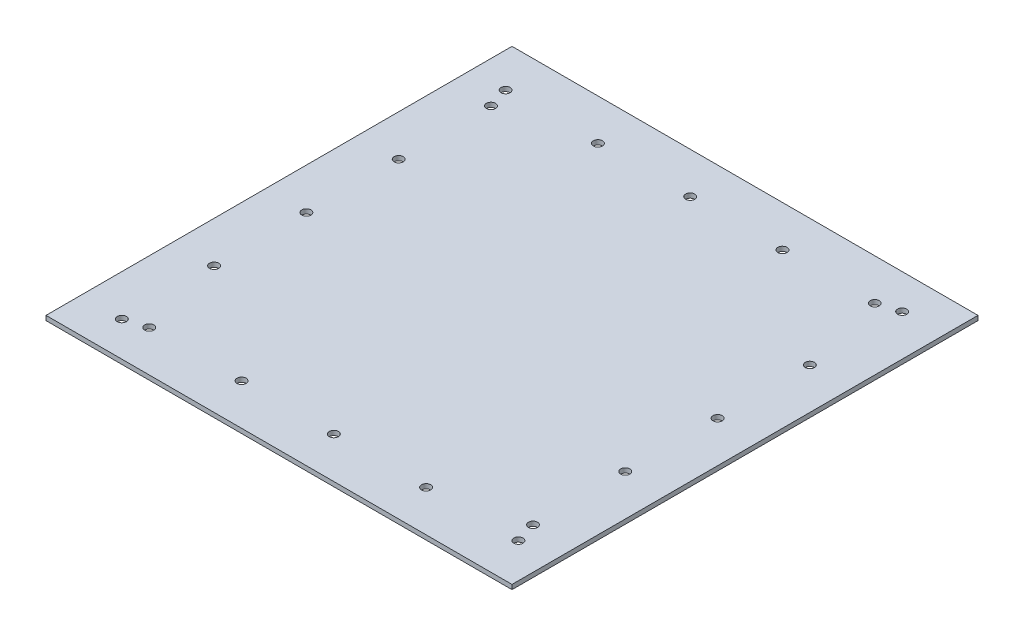
ISO-10303-21;
HEADER;
FILE_DESCRIPTION(('STEP AP214'),'2;1');
FILE_NAME('part.step','',(''),(''),'','','');
FILE_SCHEMA(('AUTOMOTIVE_DESIGN { 1 0 10303 214 1 1 1 1 }'));
ENDSEC;
DATA;
#1=APPLICATION_CONTEXT('core data for automotive mechanical design processes');
#2=APPLICATION_PROTOCOL_DEFINITION('international standard','automotive_design',2000,#1);
#3=PRODUCT_CONTEXT('',#1,'mechanical');
#4=PRODUCT('Part','Part','',(#3));
#5=PRODUCT_RELATED_PRODUCT_CATEGORY('part','',(#4));
#6=PRODUCT_DEFINITION_FORMATION('','',#4);
#7=PRODUCT_DEFINITION_CONTEXT('part definition',#1,'design');
#8=PRODUCT_DEFINITION('design','',#6,#7);
#9=PRODUCT_DEFINITION_SHAPE('','',#8);
#10=(LENGTH_UNIT() NAMED_UNIT(*) SI_UNIT(.MILLI.,.METRE.));
#11=(NAMED_UNIT(*) PLANE_ANGLE_UNIT() SI_UNIT($,.RADIAN.));
#12=(NAMED_UNIT(*) SI_UNIT($,.STERADIAN.) SOLID_ANGLE_UNIT());
#13=UNCERTAINTY_MEASURE_WITH_UNIT(LENGTH_MEASURE(1.E-05),#10,'distance_accuracy_value','');
#14=(GEOMETRIC_REPRESENTATION_CONTEXT(3) GLOBAL_UNCERTAINTY_ASSIGNED_CONTEXT((#13)) GLOBAL_UNIT_ASSIGNED_CONTEXT((#10,
#11,#12)) REPRESENTATION_CONTEXT('',''));
#15=CARTESIAN_POINT('',(0.,0.,0.));
#16=DIRECTION('',(0.,0.,1.));
#17=DIRECTION('',(1.,0.,0.));
#18=AXIS2_PLACEMENT_3D('',#15,#16,#17);
#19=CARTESIAN_POINT('',(255.,5.,255.));
#20=DIRECTION('',(-1.,0.,0.));
#21=DIRECTION('',(0.,0.,1.));
#22=AXIS2_PLACEMENT_3D('',#19,#20,#21);
#23=PLANE('',#22);
#24=DIRECTION('',(0.,0.,-1.));
#25=VECTOR('',#24,1.);
#26=CARTESIAN_POINT('',(255.,0.,255.));
#27=LINE('',#26,#25);
#28=CARTESIAN_POINT('',(255.,0.,255.));
#29=VERTEX_POINT('',#28);
#30=CARTESIAN_POINT('',(255.,0.,-255.));
#31=VERTEX_POINT('',#30);
#32=EDGE_CURVE('E109',#29,#31,#27,.T.);
#33=ORIENTED_EDGE('',*,*,#32,.T.);
#34=DIRECTION('',(0.,-1.,0.));
#35=VECTOR('',#34,1.);
#36=CARTESIAN_POINT('',(255.,5.,-255.));
#37=LINE('',#36,#35);
#38=CARTESIAN_POINT('',(255.,5.,-255.));
#39=VERTEX_POINT('',#38);
#40=EDGE_CURVE('E11',#39,#31,#37,.T.);
#41=ORIENTED_EDGE('',*,*,#40,.F.);
#42=DIRECTION('',(0.,0.,-1.));
#43=VECTOR('',#42,1.);
#44=CARTESIAN_POINT('',(255.,5.,255.));
#45=LINE('',#44,#43);
#46=CARTESIAN_POINT('',(255.,5.,255.));
#47=VERTEX_POINT('',#46);
#48=EDGE_CURVE('E92',#47,#39,#45,.T.);
#49=ORIENTED_EDGE('',*,*,#48,.F.);
#50=DIRECTION('',(0.,-1.,0.));
#51=VECTOR('',#50,1.);
#52=CARTESIAN_POINT('',(255.,5.,255.));
#53=LINE('',#52,#51);
#54=EDGE_CURVE('E105',#47,#29,#53,.T.);
#55=ORIENTED_EDGE('',*,*,#54,.T.);
#56=EDGE_LOOP('',(#33,#41,#49,#55));
#57=FACE_BOUND('',#56,.T.);
#58=ADVANCED_FACE('F39',(#57),#23,.F.);
#59=CARTESIAN_POINT('',(-255.,5.,-255.));
#60=DIRECTION('',(0.,0.,1.));
#61=DIRECTION('',(1.,0.,0.));
#62=AXIS2_PLACEMENT_3D('',#59,#60,#61);
#63=PLANE('',#62);
#64=DIRECTION('',(-1.,0.,0.));
#65=VECTOR('',#64,1.);
#66=CARTESIAN_POINT('',(-255.,0.,-255.));
#67=LINE('',#66,#65);
#68=CARTESIAN_POINT('',(-255.,0.,-255.));
#69=VERTEX_POINT('',#68);
#70=EDGE_CURVE('E97',#31,#69,#67,.T.);
#71=ORIENTED_EDGE('',*,*,#70,.T.);
#72=DIRECTION('',(0.,-1.,0.));
#73=VECTOR('',#72,1.);
#74=CARTESIAN_POINT('',(-255.,5.,-255.));
#75=LINE('',#74,#73);
#76=CARTESIAN_POINT('',(-255.,5.,-255.));
#77=VERTEX_POINT('',#76);
#78=EDGE_CURVE('E47',#77,#69,#75,.T.);
#79=ORIENTED_EDGE('',*,*,#78,.F.);
#80=DIRECTION('',(-1.,0.,0.));
#81=VECTOR('',#80,1.);
#82=CARTESIAN_POINT('',(-255.,5.,-255.));
#83=LINE('',#82,#81);
#84=EDGE_CURVE('E86',#39,#77,#83,.T.);
#85=ORIENTED_EDGE('',*,*,#84,.F.);
#86=ORIENTED_EDGE('',*,*,#40,.T.);
#87=EDGE_LOOP('',(#71,#79,#85,#86));
#88=FACE_BOUND('',#87,.T.);
#89=ADVANCED_FACE('F96',(#88),#63,.F.);
#90=CARTESIAN_POINT('',(-255.,5.,255.));
#91=DIRECTION('',(1.,0.,0.));
#92=DIRECTION('',(0.,0.,-1.));
#93=AXIS2_PLACEMENT_3D('',#90,#91,#92);
#94=PLANE('',#93);
#95=DIRECTION('',(0.,0.,1.));
#96=VECTOR('',#95,1.);
#97=CARTESIAN_POINT('',(-255.,0.,255.));
#98=LINE('',#97,#96);
#99=CARTESIAN_POINT('',(-255.,0.,255.));
#100=VERTEX_POINT('',#99);
#101=EDGE_CURVE('E73',#69,#100,#98,.T.);
#102=ORIENTED_EDGE('',*,*,#101,.T.);
#103=DIRECTION('',(0.,-1.,0.));
#104=VECTOR('',#103,1.);
#105=CARTESIAN_POINT('',(-255.,5.,255.));
#106=LINE('',#105,#104);
#107=CARTESIAN_POINT('',(-255.,5.,255.));
#108=VERTEX_POINT('',#107);
#109=EDGE_CURVE('E99',#108,#100,#106,.T.);
#110=ORIENTED_EDGE('',*,*,#109,.F.);
#111=DIRECTION('',(0.,0.,1.));
#112=VECTOR('',#111,1.);
#113=CARTESIAN_POINT('',(-255.,5.,255.));
#114=LINE('',#113,#112);
#115=EDGE_CURVE('E90',#77,#108,#114,.T.);
#116=ORIENTED_EDGE('',*,*,#115,.F.);
#117=ORIENTED_EDGE('',*,*,#78,.T.);
#118=EDGE_LOOP('',(#102,#110,#116,#117));
#119=FACE_BOUND('',#118,.T.);
#120=ADVANCED_FACE('F100',(#119),#94,.F.);
#121=CARTESIAN_POINT('',(-255.,5.,255.));
#122=DIRECTION('',(0.,0.,-1.));
#123=DIRECTION('',(-1.,0.,0.));
#124=AXIS2_PLACEMENT_3D('',#121,#122,#123);
#125=PLANE('',#124);
#126=DIRECTION('',(1.,0.,0.));
#127=VECTOR('',#126,1.);
#128=CARTESIAN_POINT('',(-255.,0.,255.));
#129=LINE('',#128,#127);
#130=EDGE_CURVE('E79',#100,#29,#129,.T.);
#131=ORIENTED_EDGE('',*,*,#130,.T.);
#132=ORIENTED_EDGE('',*,*,#54,.F.);
#133=DIRECTION('',(1.,0.,0.));
#134=VECTOR('',#133,1.);
#135=CARTESIAN_POINT('',(-255.,5.,255.));
#136=LINE('',#135,#134);
#137=EDGE_CURVE('E55',#108,#47,#136,.T.);
#138=ORIENTED_EDGE('',*,*,#137,.F.);
#139=ORIENTED_EDGE('',*,*,#109,.T.);
#140=EDGE_LOOP('',(#131,#132,#138,#139));
#141=FACE_BOUND('',#140,.T.);
#142=ADVANCED_FACE('F121',(#141),#125,.F.);
#143=CARTESIAN_POINT('',(0.,5.,0.));
#144=DIRECTION('',(0.,-1.,0.));
#145=DIRECTION('',(0.,0.,-1.));
#146=AXIS2_PLACEMENT_3D('',#143,#144,#145);
#147=PLANE('',#146);
#148=CARTESIAN_POINT('',(-209.999999999997,5.,-86.0000000000001));
#149=DIRECTION('',(0.,-1.,0.));
#150=DIRECTION('',(0.,0.,-1.));
#151=AXIS2_PLACEMENT_3D('',#148,#149,#150);
#152=CIRCLE('',#151,4.99999999999999);
#153=CARTESIAN_POINT('',(-209.999999999997,5.,-91.0000000000001));
#154=VERTEX_POINT('',#153);
#155=EDGE_CURVE('E179',#154,#154,#152,.T.);
#156=ORIENTED_EDGE('',*,*,#155,.T.);
#157=EDGE_LOOP('',(#156));
#158=FACE_BOUND('',#157,.T.);
#159=CARTESIAN_POINT('',(-209.999999999996,5.,-187.));
#160=DIRECTION('',(0.,-1.,0.));
#161=DIRECTION('',(0.,0.,-1.));
#162=AXIS2_PLACEMENT_3D('',#159,#160,#161);
#163=CIRCLE('',#162,4.99999999999999);
#164=CARTESIAN_POINT('',(-209.999999999996,5.,-192.));
#165=VERTEX_POINT('',#164);
#166=EDGE_CURVE('E204',#165,#165,#163,.T.);
#167=ORIENTED_EDGE('',*,*,#166,.T.);
#168=EDGE_LOOP('',(#167));
#169=FACE_BOUND('',#168,.T.);
#170=CARTESIAN_POINT('',(210.,5.,-217.));
#171=DIRECTION('',(0.,-1.,0.));
#172=DIRECTION('',(0.,0.,-1.));
#173=AXIS2_PLACEMENT_3D('',#170,#171,#172);
#174=CIRCLE('',#173,4.99999999999999);
#175=CARTESIAN_POINT('',(210.,5.,-222.));
#176=VERTEX_POINT('',#175);
#177=EDGE_CURVE('E197',#176,#176,#174,.T.);
#178=ORIENTED_EDGE('',*,*,#177,.T.);
#179=EDGE_LOOP('',(#178));
#180=FACE_BOUND('',#179,.T.);
#181=CARTESIAN_POINT('',(-116.,5.,-210.));
#182=DIRECTION('',(0.,-1.,0.));
#183=DIRECTION('',(0.,0.,-1.));
#184=AXIS2_PLACEMENT_3D('',#181,#182,#183);
#185=CIRCLE('',#184,4.99999999999999);
#186=CARTESIAN_POINT('',(-116.,5.,-215.));
#187=VERTEX_POINT('',#186);
#188=EDGE_CURVE('E190',#187,#187,#185,.T.);
#189=ORIENTED_EDGE('',*,*,#188,.T.);
#190=EDGE_LOOP('',(#189));
#191=FACE_BOUND('',#190,.T.);
#192=CARTESIAN_POINT('',(-15.,5.,-210.));
#193=DIRECTION('',(0.,-1.,0.));
#194=DIRECTION('',(0.,0.,-1.));
#195=AXIS2_PLACEMENT_3D('',#192,#193,#194);
#196=CIRCLE('',#195,4.99999999999999);
#197=CARTESIAN_POINT('',(-15.,5.,-215.));
#198=VERTEX_POINT('',#197);
#199=EDGE_CURVE('E191',#198,#198,#196,.T.);
#200=ORIENTED_EDGE('',*,*,#199,.T.);
#201=EDGE_LOOP('',(#200));
#202=FACE_BOUND('',#201,.T.);
#203=CARTESIAN_POINT('',(86.0000000000001,5.,-210.));
#204=DIRECTION('',(0.,-1.,0.));
#205=DIRECTION('',(0.,0.,-1.));
#206=AXIS2_PLACEMENT_3D('',#203,#204,#205);
#207=CIRCLE('',#206,4.99999999999999);
#208=CARTESIAN_POINT('',(86.0000000000001,5.,-215.));
#209=VERTEX_POINT('',#208);
#210=EDGE_CURVE('E230',#209,#209,#207,.T.);
#211=ORIENTED_EDGE('',*,*,#210,.T.);
#212=EDGE_LOOP('',(#211));
#213=FACE_BOUND('',#212,.T.);
#214=CARTESIAN_POINT('',(187.,5.,-210.));
#215=DIRECTION('',(0.,-1.,0.));
#216=DIRECTION('',(0.,0.,-1.));
#217=AXIS2_PLACEMENT_3D('',#214,#215,#216);
#218=CIRCLE('',#217,4.99999999999999);
#219=CARTESIAN_POINT('',(187.,5.,-215.));
#220=VERTEX_POINT('',#219);
#221=EDGE_CURVE('E224',#220,#220,#218,.T.);
#222=ORIENTED_EDGE('',*,*,#221,.T.);
#223=EDGE_LOOP('',(#222));
#224=FACE_BOUND('',#223,.T.);
#225=CARTESIAN_POINT('',(210.,5.,-116.));
#226=DIRECTION('',(0.,-1.,0.));
#227=DIRECTION('',(0.,0.,-1.));
#228=AXIS2_PLACEMENT_3D('',#225,#226,#227);
#229=CIRCLE('',#228,4.99999999999999);
#230=CARTESIAN_POINT('',(210.,5.,-121.));
#231=VERTEX_POINT('',#230);
#232=EDGE_CURVE('E216',#231,#231,#229,.T.);
#233=ORIENTED_EDGE('',*,*,#232,.T.);
#234=EDGE_LOOP('',(#233));
#235=FACE_BOUND('',#234,.T.);
#236=CARTESIAN_POINT('',(-86.0000000000001,5.,209.999999999998));
#237=DIRECTION('',(0.,-1.,0.));
#238=DIRECTION('',(0.,0.,-1.));
#239=AXIS2_PLACEMENT_3D('',#236,#237,#238);
#240=CIRCLE('',#239,4.99999999999999);
#241=CARTESIAN_POINT('',(-86.0000000000001,5.,204.999999999998));
#242=VERTEX_POINT('',#241);
#243=EDGE_CURVE('E150',#242,#242,#240,.T.);
#244=ORIENTED_EDGE('',*,*,#243,.T.);
#245=EDGE_LOOP('',(#244));
#246=FACE_BOUND('',#245,.T.);
#247=CARTESIAN_POINT('',(15.,5.,209.999999999999));
#248=DIRECTION('',(0.,-1.,0.));
#249=DIRECTION('',(0.,0.,-1.));
#250=AXIS2_PLACEMENT_3D('',#247,#248,#249);
#251=CIRCLE('',#250,4.99999999999999);
#252=CARTESIAN_POINT('',(15.,5.,204.999999999999));
#253=VERTEX_POINT('',#252);
#254=EDGE_CURVE('E139',#253,#253,#251,.T.);
#255=ORIENTED_EDGE('',*,*,#254,.T.);
#256=EDGE_LOOP('',(#255));
#257=FACE_BOUND('',#256,.T.);
#258=CARTESIAN_POINT('',(116.,5.,209.999999999999));
#259=DIRECTION('',(0.,-1.,0.));
#260=DIRECTION('',(0.,0.,-1.));
#261=AXIS2_PLACEMENT_3D('',#258,#259,#260);
#262=CIRCLE('',#261,4.99999999999999);
#263=CARTESIAN_POINT('',(116.,5.,204.999999999999));
#264=VERTEX_POINT('',#263);
#265=EDGE_CURVE('E138',#264,#264,#262,.T.);
#266=ORIENTED_EDGE('',*,*,#265,.T.);
#267=EDGE_LOOP('',(#266));
#268=FACE_BOUND('',#267,.T.);
#269=CARTESIAN_POINT('',(-210.,5.,217.));
#270=DIRECTION('',(0.,-1.,0.));
#271=DIRECTION('',(0.,0.,-1.));
#272=AXIS2_PLACEMENT_3D('',#269,#270,#271);
#273=CIRCLE('',#272,4.99999999999999);
#274=CARTESIAN_POINT('',(-210.,5.,212.));
#275=VERTEX_POINT('',#274);
#276=EDGE_CURVE('E132',#275,#275,#273,.T.);
#277=ORIENTED_EDGE('',*,*,#276,.T.);
#278=EDGE_LOOP('',(#277));
#279=FACE_BOUND('',#278,.T.);
#280=CARTESIAN_POINT('',(-209.999999999998,5.,15.));
#281=DIRECTION('',(0.,-1.,0.));
#282=DIRECTION('',(0.,0.,-1.));
#283=AXIS2_PLACEMENT_3D('',#280,#281,#282);
#284=CIRCLE('',#283,4.99999999999999);
#285=CARTESIAN_POINT('',(-209.999999999998,5.,9.99999999999997));
#286=VERTEX_POINT('',#285);
#287=EDGE_CURVE('E178',#286,#286,#284,.T.);
#288=ORIENTED_EDGE('',*,*,#287,.T.);
#289=EDGE_LOOP('',(#288));
#290=FACE_BOUND('',#289,.T.);
#291=CARTESIAN_POINT('',(-209.999999999999,5.,116.));
#292=DIRECTION('',(0.,-1.,0.));
#293=DIRECTION('',(0.,0.,-1.));
#294=AXIS2_PLACEMENT_3D('',#291,#292,#293);
#295=CIRCLE('',#294,4.99999999999999);
#296=CARTESIAN_POINT('',(-209.999999999999,5.,111.));
#297=VERTEX_POINT('',#296);
#298=EDGE_CURVE('E166',#297,#297,#295,.T.);
#299=ORIENTED_EDGE('',*,*,#298,.T.);
#300=EDGE_LOOP('',(#299));
#301=FACE_BOUND('',#300,.T.);
#302=CARTESIAN_POINT('',(-217.,5.,-210.));
#303=DIRECTION('',(0.,-1.,0.));
#304=DIRECTION('',(0.,0.,-1.));
#305=AXIS2_PLACEMENT_3D('',#302,#303,#304);
#306=CIRCLE('',#305,4.99999999999999);
#307=CARTESIAN_POINT('',(-217.,5.,-215.));
#308=VERTEX_POINT('',#307);
#309=EDGE_CURVE('E165',#308,#308,#306,.T.);
#310=ORIENTED_EDGE('',*,*,#309,.T.);
#311=EDGE_LOOP('',(#310));
#312=FACE_BOUND('',#311,.T.);
#313=CARTESIAN_POINT('',(-187.,5.,209.999999999997));
#314=DIRECTION('',(0.,-1.,0.));
#315=DIRECTION('',(0.,0.,-1.));
#316=AXIS2_PLACEMENT_3D('',#313,#314,#315);
#317=CIRCLE('',#316,4.99999999999999);
#318=CARTESIAN_POINT('',(-187.,5.,204.999999999997));
#319=VERTEX_POINT('',#318);
#320=EDGE_CURVE('E151',#319,#319,#317,.T.);
#321=ORIENTED_EDGE('',*,*,#320,.T.);
#322=EDGE_LOOP('',(#321));
#323=FACE_BOUND('',#322,.T.);
#324=CARTESIAN_POINT('',(209.999999999999,5.,-15.));
#325=DIRECTION('',(0.,-1.,0.));
#326=DIRECTION('',(0.,0.,-1.));
#327=AXIS2_PLACEMENT_3D('',#324,#325,#326);
#328=CIRCLE('',#327,4.99999999999999);
#329=CARTESIAN_POINT('',(209.999999999999,5.,-19.9999999999999));
#330=VERTEX_POINT('',#329);
#331=EDGE_CURVE('E217',#330,#330,#328,.T.);
#332=ORIENTED_EDGE('',*,*,#331,.T.);
#333=EDGE_LOOP('',(#332));
#334=FACE_BOUND('',#333,.T.);
#335=CARTESIAN_POINT('',(209.999999999999,5.,86.0000000000001));
#336=DIRECTION('',(0.,-1.,0.));
#337=DIRECTION('',(0.,0.,-1.));
#338=AXIS2_PLACEMENT_3D('',#335,#336,#337);
#339=CIRCLE('',#338,4.99999999999999);
#340=CARTESIAN_POINT('',(209.999999999999,5.,81.0000000000001));
#341=VERTEX_POINT('',#340);
#342=EDGE_CURVE('E247',#341,#341,#339,.T.);
#343=ORIENTED_EDGE('',*,*,#342,.T.);
#344=EDGE_LOOP('',(#343));
#345=FACE_BOUND('',#344,.T.);
#346=CARTESIAN_POINT('',(209.999999999999,5.,187.));
#347=DIRECTION('',(0.,-1.,0.));
#348=DIRECTION('',(0.,0.,-1.));
#349=AXIS2_PLACEMENT_3D('',#346,#347,#348);
#350=CIRCLE('',#349,4.99999999999999);
#351=CARTESIAN_POINT('',(209.999999999999,5.,182.));
#352=VERTEX_POINT('',#351);
#353=EDGE_CURVE('E241',#352,#352,#350,.T.);
#354=ORIENTED_EDGE('',*,*,#353,.T.);
#355=EDGE_LOOP('',(#354));
#356=FACE_BOUND('',#355,.T.);
#357=CARTESIAN_POINT('',(217.,5.,210.));
#358=DIRECTION('',(0.,-1.,0.));
#359=DIRECTION('',(0.,0.,-1.));
#360=AXIS2_PLACEMENT_3D('',#357,#358,#359);
#361=CIRCLE('',#360,4.99999999999999);
#362=CARTESIAN_POINT('',(217.,5.,205.));
#363=VERTEX_POINT('',#362);
#364=EDGE_CURVE('E113',#363,#363,#361,.T.);
#365=ORIENTED_EDGE('',*,*,#364,.T.);
#366=EDGE_LOOP('',(#365));
#367=FACE_BOUND('',#366,.T.);
#368=ORIENTED_EDGE('',*,*,#48,.T.);
#369=ORIENTED_EDGE('',*,*,#84,.T.);
#370=ORIENTED_EDGE('',*,*,#115,.T.);
#371=ORIENTED_EDGE('',*,*,#137,.T.);
#372=EDGE_LOOP('',(#368,#369,#370,#371));
#373=FACE_BOUND('',#372,.T.);
#374=ADVANCED_FACE('F88',(#158,#169,#180,#191,#202,#213,#224,#235,#246,#257,#268,#279,#290,#301,
#312,#323,#334,#345,#356,#367,#373),#147,.F.);
#375=CARTESIAN_POINT('',(0.,0.,0.));
#376=DIRECTION('',(0.,-1.,0.));
#377=DIRECTION('',(0.,0.,-1.));
#378=AXIS2_PLACEMENT_3D('',#375,#376,#377);
#379=PLANE('',#378);
#380=CARTESIAN_POINT('',(-209.999999999997,0.,-86.0000000000001));
#381=DIRECTION('',(0.,-1.,0.));
#382=DIRECTION('',(0.,0.,-1.));
#383=AXIS2_PLACEMENT_3D('',#380,#381,#382);
#384=CIRCLE('',#383,4.99999999999999);
#385=CARTESIAN_POINT('',(-209.999999999997,0.,-91.0000000000001));
#386=VERTEX_POINT('',#385);
#387=EDGE_CURVE('E207',#386,#386,#384,.T.);
#388=ORIENTED_EDGE('',*,*,#387,.F.);
#389=EDGE_LOOP('',(#388));
#390=FACE_BOUND('',#389,.T.);
#391=CARTESIAN_POINT('',(-209.999999999996,0.,-187.));
#392=DIRECTION('',(0.,-1.,0.));
#393=DIRECTION('',(0.,0.,-1.));
#394=AXIS2_PLACEMENT_3D('',#391,#392,#393);
#395=CIRCLE('',#394,4.99999999999999);
#396=CARTESIAN_POINT('',(-209.999999999996,0.,-192.));
#397=VERTEX_POINT('',#396);
#398=EDGE_CURVE('E200',#397,#397,#395,.T.);
#399=ORIENTED_EDGE('',*,*,#398,.F.);
#400=EDGE_LOOP('',(#399));
#401=FACE_BOUND('',#400,.T.);
#402=CARTESIAN_POINT('',(210.,0.,-217.));
#403=DIRECTION('',(0.,-1.,0.));
#404=DIRECTION('',(0.,0.,-1.));
#405=AXIS2_PLACEMENT_3D('',#402,#403,#404);
#406=CIRCLE('',#405,4.99999999999999);
#407=CARTESIAN_POINT('',(210.,0.,-222.));
#408=VERTEX_POINT('',#407);
#409=EDGE_CURVE('E194',#408,#408,#406,.T.);
#410=ORIENTED_EDGE('',*,*,#409,.F.);
#411=EDGE_LOOP('',(#410));
#412=FACE_BOUND('',#411,.T.);
#413=CARTESIAN_POINT('',(-116.,0.,-210.));
#414=DIRECTION('',(0.,-1.,0.));
#415=DIRECTION('',(0.,0.,-1.));
#416=AXIS2_PLACEMENT_3D('',#413,#414,#415);
#417=CIRCLE('',#416,4.99999999999999);
#418=CARTESIAN_POINT('',(-116.,0.,-215.));
#419=VERTEX_POINT('',#418);
#420=EDGE_CURVE('E187',#419,#419,#417,.T.);
#421=ORIENTED_EDGE('',*,*,#420,.F.);
#422=EDGE_LOOP('',(#421));
#423=FACE_BOUND('',#422,.T.);
#424=CARTESIAN_POINT('',(-15.,0.,-210.));
#425=DIRECTION('',(0.,-1.,0.));
#426=DIRECTION('',(0.,0.,-1.));
#427=AXIS2_PLACEMENT_3D('',#424,#425,#426);
#428=CIRCLE('',#427,4.99999999999999);
#429=CARTESIAN_POINT('',(-15.,0.,-215.));
#430=VERTEX_POINT('',#429);
#431=EDGE_CURVE('E233',#430,#430,#428,.T.);
#432=ORIENTED_EDGE('',*,*,#431,.F.);
#433=EDGE_LOOP('',(#432));
#434=FACE_BOUND('',#433,.T.);
#435=CARTESIAN_POINT('',(86.0000000000001,0.,-210.));
#436=DIRECTION('',(0.,-1.,0.));
#437=DIRECTION('',(0.,0.,-1.));
#438=AXIS2_PLACEMENT_3D('',#435,#436,#437);
#439=CIRCLE('',#438,4.99999999999999);
#440=CARTESIAN_POINT('',(86.0000000000001,0.,-215.));
#441=VERTEX_POINT('',#440);
#442=EDGE_CURVE('E227',#441,#441,#439,.T.);
#443=ORIENTED_EDGE('',*,*,#442,.F.);
#444=EDGE_LOOP('',(#443));
#445=FACE_BOUND('',#444,.T.);
#446=CARTESIAN_POINT('',(187.,0.,-210.));
#447=DIRECTION('',(0.,-1.,0.));
#448=DIRECTION('',(0.,0.,-1.));
#449=AXIS2_PLACEMENT_3D('',#446,#447,#448);
#450=CIRCLE('',#449,4.99999999999999);
#451=CARTESIAN_POINT('',(187.,0.,-215.));
#452=VERTEX_POINT('',#451);
#453=EDGE_CURVE('E221',#452,#452,#450,.T.);
#454=ORIENTED_EDGE('',*,*,#453,.F.);
#455=EDGE_LOOP('',(#454));
#456=FACE_BOUND('',#455,.T.);
#457=CARTESIAN_POINT('',(210.,0.,-116.));
#458=DIRECTION('',(0.,-1.,0.));
#459=DIRECTION('',(0.,0.,-1.));
#460=AXIS2_PLACEMENT_3D('',#457,#458,#459);
#461=CIRCLE('',#460,4.99999999999999);
#462=CARTESIAN_POINT('',(210.,0.,-121.));
#463=VERTEX_POINT('',#462);
#464=EDGE_CURVE('E212',#463,#463,#461,.T.);
#465=ORIENTED_EDGE('',*,*,#464,.F.);
#466=EDGE_LOOP('',(#465));
#467=FACE_BOUND('',#466,.T.);
#468=CARTESIAN_POINT('',(-86.0000000000001,0.,209.999999999998));
#469=DIRECTION('',(0.,-1.,0.));
#470=DIRECTION('',(0.,0.,-1.));
#471=AXIS2_PLACEMENT_3D('',#468,#469,#470);
#472=CIRCLE('',#471,4.99999999999999);
#473=CARTESIAN_POINT('',(-86.0000000000001,0.,204.999999999998));
#474=VERTEX_POINT('',#473);
#475=EDGE_CURVE('E147',#474,#474,#472,.T.);
#476=ORIENTED_EDGE('',*,*,#475,.F.);
#477=EDGE_LOOP('',(#476));
#478=FACE_BOUND('',#477,.T.);
#479=CARTESIAN_POINT('',(15.,0.,209.999999999999));
#480=DIRECTION('',(0.,-1.,0.));
#481=DIRECTION('',(0.,0.,-1.));
#482=AXIS2_PLACEMENT_3D('',#479,#480,#481);
#483=CIRCLE('',#482,4.99999999999999);
#484=CARTESIAN_POINT('',(15.,0.,204.999999999999));
#485=VERTEX_POINT('',#484);
#486=EDGE_CURVE('E154',#485,#485,#483,.T.);
#487=ORIENTED_EDGE('',*,*,#486,.F.);
#488=EDGE_LOOP('',(#487));
#489=FACE_BOUND('',#488,.T.);
#490=CARTESIAN_POINT('',(116.,0.,209.999999999999));
#491=DIRECTION('',(0.,-1.,0.));
#492=DIRECTION('',(0.,0.,-1.));
#493=AXIS2_PLACEMENT_3D('',#490,#491,#492);
#494=CIRCLE('',#493,4.99999999999999);
#495=CARTESIAN_POINT('',(116.,0.,204.999999999999));
#496=VERTEX_POINT('',#495);
#497=EDGE_CURVE('E135',#496,#496,#494,.T.);
#498=ORIENTED_EDGE('',*,*,#497,.F.);
#499=EDGE_LOOP('',(#498));
#500=FACE_BOUND('',#499,.T.);
#501=CARTESIAN_POINT('',(-210.,0.,217.));
#502=DIRECTION('',(0.,-1.,0.));
#503=DIRECTION('',(0.,0.,-1.));
#504=AXIS2_PLACEMENT_3D('',#501,#502,#503);
#505=CIRCLE('',#504,4.99999999999999);
#506=CARTESIAN_POINT('',(-210.,0.,212.));
#507=VERTEX_POINT('',#506);
#508=EDGE_CURVE('E142',#507,#507,#505,.T.);
#509=ORIENTED_EDGE('',*,*,#508,.F.);
#510=EDGE_LOOP('',(#509));
#511=FACE_BOUND('',#510,.T.);
#512=CARTESIAN_POINT('',(-209.999999999998,0.,15.));
#513=DIRECTION('',(0.,-1.,0.));
#514=DIRECTION('',(0.,0.,-1.));
#515=AXIS2_PLACEMENT_3D('',#512,#513,#514);
#516=CIRCLE('',#515,4.99999999999999);
#517=CARTESIAN_POINT('',(-209.999999999998,0.,9.99999999999997));
#518=VERTEX_POINT('',#517);
#519=EDGE_CURVE('E175',#518,#518,#516,.T.);
#520=ORIENTED_EDGE('',*,*,#519,.F.);
#521=EDGE_LOOP('',(#520));
#522=FACE_BOUND('',#521,.T.);
#523=CARTESIAN_POINT('',(-209.999999999999,0.,116.));
#524=DIRECTION('',(0.,-1.,0.));
#525=DIRECTION('',(0.,0.,-1.));
#526=AXIS2_PLACEMENT_3D('',#523,#524,#525);
#527=CIRCLE('',#526,4.99999999999999);
#528=CARTESIAN_POINT('',(-209.999999999999,0.,111.));
#529=VERTEX_POINT('',#528);
#530=EDGE_CURVE('E182',#529,#529,#527,.T.);
#531=ORIENTED_EDGE('',*,*,#530,.F.);
#532=EDGE_LOOP('',(#531));
#533=FACE_BOUND('',#532,.T.);
#534=CARTESIAN_POINT('',(-217.,0.,-210.));
#535=DIRECTION('',(0.,-1.,0.));
#536=DIRECTION('',(0.,0.,-1.));
#537=AXIS2_PLACEMENT_3D('',#534,#535,#536);
#538=CIRCLE('',#537,4.99999999999999);
#539=CARTESIAN_POINT('',(-217.,0.,-215.));
#540=VERTEX_POINT('',#539);
#541=EDGE_CURVE('E161',#540,#540,#538,.T.);
#542=ORIENTED_EDGE('',*,*,#541,.F.);
#543=EDGE_LOOP('',(#542));
#544=FACE_BOUND('',#543,.T.);
#545=CARTESIAN_POINT('',(-187.,0.,209.999999999997));
#546=DIRECTION('',(0.,-1.,0.));
#547=DIRECTION('',(0.,0.,-1.));
#548=AXIS2_PLACEMENT_3D('',#545,#546,#547);
#549=CIRCLE('',#548,4.99999999999999);
#550=CARTESIAN_POINT('',(-187.,0.,204.999999999997));
#551=VERTEX_POINT('',#550);
#552=EDGE_CURVE('E170',#551,#551,#549,.T.);
#553=ORIENTED_EDGE('',*,*,#552,.F.);
#554=EDGE_LOOP('',(#553));
#555=FACE_BOUND('',#554,.T.);
#556=CARTESIAN_POINT('',(209.999999999999,0.,-15.));
#557=DIRECTION('',(0.,-1.,0.));
#558=DIRECTION('',(0.,0.,-1.));
#559=AXIS2_PLACEMENT_3D('',#556,#557,#558);
#560=CIRCLE('',#559,4.99999999999999);
#561=CARTESIAN_POINT('',(209.999999999999,0.,-19.9999999999999));
#562=VERTEX_POINT('',#561);
#563=EDGE_CURVE('E251',#562,#562,#560,.T.);
#564=ORIENTED_EDGE('',*,*,#563,.F.);
#565=EDGE_LOOP('',(#564));
#566=FACE_BOUND('',#565,.T.);
#567=CARTESIAN_POINT('',(209.999999999999,0.,86.0000000000001));
#568=DIRECTION('',(0.,-1.,0.));
#569=DIRECTION('',(0.,0.,-1.));
#570=AXIS2_PLACEMENT_3D('',#567,#568,#569);
#571=CIRCLE('',#570,4.99999999999999);
#572=CARTESIAN_POINT('',(209.999999999999,0.,81.0000000000001));
#573=VERTEX_POINT('',#572);
#574=EDGE_CURVE('E244',#573,#573,#571,.T.);
#575=ORIENTED_EDGE('',*,*,#574,.F.);
#576=EDGE_LOOP('',(#575));
#577=FACE_BOUND('',#576,.T.);
#578=CARTESIAN_POINT('',(209.999999999999,0.,187.));
#579=DIRECTION('',(0.,-1.,0.));
#580=DIRECTION('',(0.,0.,-1.));
#581=AXIS2_PLACEMENT_3D('',#578,#579,#580);
#582=CIRCLE('',#581,4.99999999999999);
#583=CARTESIAN_POINT('',(209.999999999999,0.,182.));
#584=VERTEX_POINT('',#583);
#585=EDGE_CURVE('E238',#584,#584,#582,.T.);
#586=ORIENTED_EDGE('',*,*,#585,.F.);
#587=EDGE_LOOP('',(#586));
#588=FACE_BOUND('',#587,.T.);
#589=CARTESIAN_POINT('',(217.,0.,210.));
#590=DIRECTION('',(0.,-1.,0.));
#591=DIRECTION('',(0.,0.,-1.));
#592=AXIS2_PLACEMENT_3D('',#589,#590,#591);
#593=CIRCLE('',#592,4.99999999999999);
#594=CARTESIAN_POINT('',(217.,0.,205.));
#595=VERTEX_POINT('',#594);
#596=EDGE_CURVE('E129',#595,#595,#593,.T.);
#597=ORIENTED_EDGE('',*,*,#596,.F.);
#598=EDGE_LOOP('',(#597));
#599=FACE_BOUND('',#598,.T.);
#600=ORIENTED_EDGE('',*,*,#32,.F.);
#601=ORIENTED_EDGE('',*,*,#130,.F.);
#602=ORIENTED_EDGE('',*,*,#101,.F.);
#603=ORIENTED_EDGE('',*,*,#70,.F.);
#604=EDGE_LOOP('',(#600,#601,#602,#603));
#605=FACE_BOUND('',#604,.T.);
#606=ADVANCED_FACE('F124',(#390,#401,#412,#423,#434,#445,#456,#467,#478,#489,#500,#511,#522,
#533,#544,#555,#566,#577,#588,#599,#605),#379,.T.);
#607=CARTESIAN_POINT('',(217.,5.,210.));
#608=DIRECTION('',(0.,-1.,0.));
#609=DIRECTION('',(0.,0.,-1.));
#610=AXIS2_PLACEMENT_3D('',#607,#608,#609);
#611=CYLINDRICAL_SURFACE('',#610,4.99999999999999);
#612=ORIENTED_EDGE('',*,*,#364,.F.);
#613=EDGE_LOOP('',(#612));
#614=FACE_BOUND('',#613,.T.);
#615=ORIENTED_EDGE('',*,*,#596,.T.);
#616=EDGE_LOOP('',(#615));
#617=FACE_BOUND('',#616,.T.);
#618=ADVANCED_FACE('F269',(#614,#617),#611,.F.);
#619=CARTESIAN_POINT('',(209.999999999999,5.,187.));
#620=DIRECTION('',(0.,-1.,0.));
#621=DIRECTION('',(0.,0.,-1.));
#622=AXIS2_PLACEMENT_3D('',#619,#620,#621);
#623=CYLINDRICAL_SURFACE('',#622,4.99999999999999);
#624=ORIENTED_EDGE('',*,*,#353,.F.);
#625=EDGE_LOOP('',(#624));
#626=FACE_BOUND('',#625,.T.);
#627=ORIENTED_EDGE('',*,*,#585,.T.);
#628=EDGE_LOOP('',(#627));
#629=FACE_BOUND('',#628,.T.);
#630=ADVANCED_FACE('F279',(#626,#629),#623,.F.);
#631=CARTESIAN_POINT('',(209.999999999999,5.,86.0000000000001));
#632=DIRECTION('',(0.,-1.,0.));
#633=DIRECTION('',(0.,0.,-1.));
#634=AXIS2_PLACEMENT_3D('',#631,#632,#633);
#635=CYLINDRICAL_SURFACE('',#634,4.99999999999999);
#636=ORIENTED_EDGE('',*,*,#342,.F.);
#637=EDGE_LOOP('',(#636));
#638=FACE_BOUND('',#637,.T.);
#639=ORIENTED_EDGE('',*,*,#574,.T.);
#640=EDGE_LOOP('',(#639));
#641=FACE_BOUND('',#640,.T.);
#642=ADVANCED_FACE('F263',(#638,#641),#635,.F.);
#643=CARTESIAN_POINT('',(209.999999999999,5.,-15.));
#644=DIRECTION('',(0.,-1.,0.));
#645=DIRECTION('',(0.,0.,-1.));
#646=AXIS2_PLACEMENT_3D('',#643,#644,#645);
#647=CYLINDRICAL_SURFACE('',#646,4.99999999999999);
#648=ORIENTED_EDGE('',*,*,#331,.F.);
#649=EDGE_LOOP('',(#648));
#650=FACE_BOUND('',#649,.T.);
#651=ORIENTED_EDGE('',*,*,#563,.T.);
#652=EDGE_LOOP('',(#651));
#653=FACE_BOUND('',#652,.T.);
#654=ADVANCED_FACE('F259',(#650,#653),#647,.F.);
#655=CARTESIAN_POINT('',(-187.,5.,209.999999999997));
#656=DIRECTION('',(0.,-1.,0.));
#657=DIRECTION('',(0.,0.,-1.));
#658=AXIS2_PLACEMENT_3D('',#655,#656,#657);
#659=CYLINDRICAL_SURFACE('',#658,4.99999999999999);
#660=ORIENTED_EDGE('',*,*,#320,.F.);
#661=EDGE_LOOP('',(#660));
#662=FACE_BOUND('',#661,.T.);
#663=ORIENTED_EDGE('',*,*,#552,.T.);
#664=EDGE_LOOP('',(#663));
#665=FACE_BOUND('',#664,.T.);
#666=ADVANCED_FACE('F262',(#662,#665),#659,.F.);
#667=CARTESIAN_POINT('',(-217.,5.,-210.));
#668=DIRECTION('',(0.,-1.,0.));
#669=DIRECTION('',(0.,0.,-1.));
#670=AXIS2_PLACEMENT_3D('',#667,#668,#669);
#671=CYLINDRICAL_SURFACE('',#670,4.99999999999999);
#672=ORIENTED_EDGE('',*,*,#309,.F.);
#673=EDGE_LOOP('',(#672));
#674=FACE_BOUND('',#673,.T.);
#675=ORIENTED_EDGE('',*,*,#541,.T.);
#676=EDGE_LOOP('',(#675));
#677=FACE_BOUND('',#676,.T.);
#678=ADVANCED_FACE('F338',(#674,#677),#671,.F.);
#679=CARTESIAN_POINT('',(-209.999999999999,5.,116.));
#680=DIRECTION('',(0.,-1.,0.));
#681=DIRECTION('',(0.,0.,-1.));
#682=AXIS2_PLACEMENT_3D('',#679,#680,#681);
#683=CYLINDRICAL_SURFACE('',#682,4.99999999999999);
#684=ORIENTED_EDGE('',*,*,#298,.F.);
#685=EDGE_LOOP('',(#684));
#686=FACE_BOUND('',#685,.T.);
#687=ORIENTED_EDGE('',*,*,#530,.T.);
#688=EDGE_LOOP('',(#687));
#689=FACE_BOUND('',#688,.T.);
#690=ADVANCED_FACE('F345',(#686,#689),#683,.F.);
#691=CARTESIAN_POINT('',(-209.999999999998,5.,15.));
#692=DIRECTION('',(0.,-1.,0.));
#693=DIRECTION('',(0.,0.,-1.));
#694=AXIS2_PLACEMENT_3D('',#691,#692,#693);
#695=CYLINDRICAL_SURFACE('',#694,4.99999999999999);
#696=ORIENTED_EDGE('',*,*,#287,.F.);
#697=EDGE_LOOP('',(#696));
#698=FACE_BOUND('',#697,.T.);
#699=ORIENTED_EDGE('',*,*,#519,.T.);
#700=EDGE_LOOP('',(#699));
#701=FACE_BOUND('',#700,.T.);
#702=ADVANCED_FACE('F349',(#698,#701),#695,.F.);
#703=CARTESIAN_POINT('',(-210.,5.,217.));
#704=DIRECTION('',(0.,-1.,0.));
#705=DIRECTION('',(0.,0.,-1.));
#706=AXIS2_PLACEMENT_3D('',#703,#704,#705);
#707=CYLINDRICAL_SURFACE('',#706,4.99999999999999);
#708=ORIENTED_EDGE('',*,*,#276,.F.);
#709=EDGE_LOOP('',(#708));
#710=FACE_BOUND('',#709,.T.);
#711=ORIENTED_EDGE('',*,*,#508,.T.);
#712=EDGE_LOOP('',(#711));
#713=FACE_BOUND('',#712,.T.);
#714=ADVANCED_FACE('F362',(#710,#713),#707,.F.);
#715=CARTESIAN_POINT('',(116.,5.,209.999999999999));
#716=DIRECTION('',(0.,-1.,0.));
#717=DIRECTION('',(0.,0.,-1.));
#718=AXIS2_PLACEMENT_3D('',#715,#716,#717);
#719=CYLINDRICAL_SURFACE('',#718,4.99999999999999);
#720=ORIENTED_EDGE('',*,*,#265,.F.);
#721=EDGE_LOOP('',(#720));
#722=FACE_BOUND('',#721,.T.);
#723=ORIENTED_EDGE('',*,*,#497,.T.);
#724=EDGE_LOOP('',(#723));
#725=FACE_BOUND('',#724,.T.);
#726=ADVANCED_FACE('F356',(#722,#725),#719,.F.);
#727=CARTESIAN_POINT('',(15.,5.,209.999999999999));
#728=DIRECTION('',(0.,-1.,0.));
#729=DIRECTION('',(0.,0.,-1.));
#730=AXIS2_PLACEMENT_3D('',#727,#728,#729);
#731=CYLINDRICAL_SURFACE('',#730,4.99999999999999);
#732=ORIENTED_EDGE('',*,*,#254,.F.);
#733=EDGE_LOOP('',(#732));
#734=FACE_BOUND('',#733,.T.);
#735=ORIENTED_EDGE('',*,*,#486,.T.);
#736=EDGE_LOOP('',(#735));
#737=FACE_BOUND('',#736,.T.);
#738=ADVANCED_FACE('F352',(#734,#737),#731,.F.);
#739=CARTESIAN_POINT('',(-86.0000000000001,5.,209.999999999998));
#740=DIRECTION('',(0.,-1.,0.));
#741=DIRECTION('',(0.,0.,-1.));
#742=AXIS2_PLACEMENT_3D('',#739,#740,#741);
#743=CYLINDRICAL_SURFACE('',#742,4.99999999999999);
#744=ORIENTED_EDGE('',*,*,#243,.F.);
#745=EDGE_LOOP('',(#744));
#746=FACE_BOUND('',#745,.T.);
#747=ORIENTED_EDGE('',*,*,#475,.T.);
#748=EDGE_LOOP('',(#747));
#749=FACE_BOUND('',#748,.T.);
#750=ADVANCED_FACE('F355',(#746,#749),#743,.F.);
#751=CARTESIAN_POINT('',(210.,5.,-116.));
#752=DIRECTION('',(0.,-1.,0.));
#753=DIRECTION('',(0.,0.,-1.));
#754=AXIS2_PLACEMENT_3D('',#751,#752,#753);
#755=CYLINDRICAL_SURFACE('',#754,4.99999999999999);
#756=ORIENTED_EDGE('',*,*,#232,.F.);
#757=EDGE_LOOP('',(#756));
#758=FACE_BOUND('',#757,.T.);
#759=ORIENTED_EDGE('',*,*,#464,.T.);
#760=EDGE_LOOP('',(#759));
#761=FACE_BOUND('',#760,.T.);
#762=ADVANCED_FACE('F360',(#758,#761),#755,.F.);
#763=CARTESIAN_POINT('',(187.,5.,-210.));
#764=DIRECTION('',(0.,-1.,0.));
#765=DIRECTION('',(0.,0.,-1.));
#766=AXIS2_PLACEMENT_3D('',#763,#764,#765);
#767=CYLINDRICAL_SURFACE('',#766,4.99999999999999);
#768=ORIENTED_EDGE('',*,*,#221,.F.);
#769=EDGE_LOOP('',(#768));
#770=FACE_BOUND('',#769,.T.);
#771=ORIENTED_EDGE('',*,*,#453,.T.);
#772=EDGE_LOOP('',(#771));
#773=FACE_BOUND('',#772,.T.);
#774=ADVANCED_FACE('F408',(#770,#773),#767,.F.);
#775=CARTESIAN_POINT('',(86.0000000000001,5.,-210.));
#776=DIRECTION('',(0.,-1.,0.));
#777=DIRECTION('',(0.,0.,-1.));
#778=AXIS2_PLACEMENT_3D('',#775,#776,#777);
#779=CYLINDRICAL_SURFACE('',#778,4.99999999999999);
#780=ORIENTED_EDGE('',*,*,#210,.F.);
#781=EDGE_LOOP('',(#780));
#782=FACE_BOUND('',#781,.T.);
#783=ORIENTED_EDGE('',*,*,#442,.T.);
#784=EDGE_LOOP('',(#783));
#785=FACE_BOUND('',#784,.T.);
#786=ADVANCED_FACE('F412',(#782,#785),#779,.F.);
#787=CARTESIAN_POINT('',(-15.,5.,-210.));
#788=DIRECTION('',(0.,-1.,0.));
#789=DIRECTION('',(0.,0.,-1.));
#790=AXIS2_PLACEMENT_3D('',#787,#788,#789);
#791=CYLINDRICAL_SURFACE('',#790,4.99999999999999);
#792=ORIENTED_EDGE('',*,*,#199,.F.);
#793=EDGE_LOOP('',(#792));
#794=FACE_BOUND('',#793,.T.);
#795=ORIENTED_EDGE('',*,*,#431,.T.);
#796=EDGE_LOOP('',(#795));
#797=FACE_BOUND('',#796,.T.);
#798=ADVANCED_FACE('F393',(#794,#797),#791,.F.);
#799=CARTESIAN_POINT('',(-116.,5.,-210.));
#800=DIRECTION('',(0.,-1.,0.));
#801=DIRECTION('',(0.,0.,-1.));
#802=AXIS2_PLACEMENT_3D('',#799,#800,#801);
#803=CYLINDRICAL_SURFACE('',#802,4.99999999999999);
#804=ORIENTED_EDGE('',*,*,#188,.F.);
#805=EDGE_LOOP('',(#804));
#806=FACE_BOUND('',#805,.T.);
#807=ORIENTED_EDGE('',*,*,#420,.T.);
#808=EDGE_LOOP('',(#807));
#809=FACE_BOUND('',#808,.T.);
#810=ADVANCED_FACE('F389',(#806,#809),#803,.F.);
#811=CARTESIAN_POINT('',(210.,5.,-217.));
#812=DIRECTION('',(0.,-1.,0.));
#813=DIRECTION('',(0.,0.,-1.));
#814=AXIS2_PLACEMENT_3D('',#811,#812,#813);
#815=CYLINDRICAL_SURFACE('',#814,4.99999999999999);
#816=ORIENTED_EDGE('',*,*,#177,.F.);
#817=EDGE_LOOP('',(#816));
#818=FACE_BOUND('',#817,.T.);
#819=ORIENTED_EDGE('',*,*,#409,.T.);
#820=EDGE_LOOP('',(#819));
#821=FACE_BOUND('',#820,.T.);
#822=ADVANCED_FACE('F392',(#818,#821),#815,.F.);
#823=CARTESIAN_POINT('',(-209.999999999996,5.,-187.));
#824=DIRECTION('',(0.,-1.,0.));
#825=DIRECTION('',(0.,0.,-1.));
#826=AXIS2_PLACEMENT_3D('',#823,#824,#825);
#827=CYLINDRICAL_SURFACE('',#826,4.99999999999999);
#828=ORIENTED_EDGE('',*,*,#166,.F.);
#829=EDGE_LOOP('',(#828));
#830=FACE_BOUND('',#829,.T.);
#831=ORIENTED_EDGE('',*,*,#398,.T.);
#832=EDGE_LOOP('',(#831));
#833=FACE_BOUND('',#832,.T.);
#834=ADVANCED_FACE('F397',(#830,#833),#827,.F.);
#835=CARTESIAN_POINT('',(-209.999999999997,5.,-86.0000000000001));
#836=DIRECTION('',(0.,-1.,0.));
#837=DIRECTION('',(0.,0.,-1.));
#838=AXIS2_PLACEMENT_3D('',#835,#836,#837);
#839=CYLINDRICAL_SURFACE('',#838,4.99999999999999);
#840=ORIENTED_EDGE('',*,*,#155,.F.);
#841=EDGE_LOOP('',(#840));
#842=FACE_BOUND('',#841,.T.);
#843=ORIENTED_EDGE('',*,*,#387,.T.);
#844=EDGE_LOOP('',(#843));
#845=FACE_BOUND('',#844,.T.);
#846=ADVANCED_FACE('F401',(#842,#845),#839,.F.);
#847=CLOSED_SHELL('',(#58,#89,#120,#142,#374,#606,#618,#630,#642,#654,#666,#678,#690,#702,#714,
#726,#738,#750,#762,#774,#786,#798,#810,#822,#834,#846));
#848=MANIFOLD_SOLID_BREP('B2',#847);
#849=ADVANCED_BREP_SHAPE_REPRESENTATION('',(#18,#848),#14);
#850=SHAPE_DEFINITION_REPRESENTATION(#9,#849);
ENDSEC;
END-ISO-10303-21;
